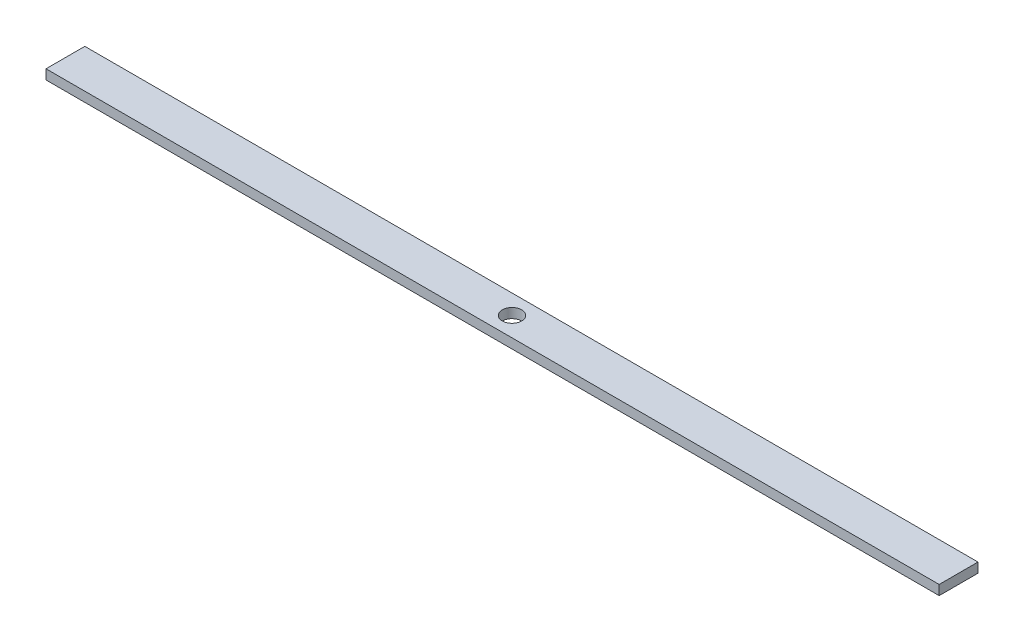
ISO-10303-21;
HEADER;
FILE_DESCRIPTION(('STEP AP214'),'2;1');
FILE_NAME('part.step','',(''),(''),'','','');
FILE_SCHEMA(('AUTOMOTIVE_DESIGN { 1 0 10303 214 1 1 1 1 }'));
ENDSEC;
DATA;
#1=APPLICATION_CONTEXT('core data for automotive mechanical design processes');
#2=APPLICATION_PROTOCOL_DEFINITION('international standard','automotive_design',2000,#1);
#3=PRODUCT_CONTEXT('',#1,'mechanical');
#4=PRODUCT('Part','Part','',(#3));
#5=PRODUCT_RELATED_PRODUCT_CATEGORY('part','',(#4));
#6=PRODUCT_DEFINITION_FORMATION('','',#4);
#7=PRODUCT_DEFINITION_CONTEXT('part definition',#1,'design');
#8=PRODUCT_DEFINITION('design','',#6,#7);
#9=PRODUCT_DEFINITION_SHAPE('','',#8);
#10=(LENGTH_UNIT() NAMED_UNIT(*) SI_UNIT(.MILLI.,.METRE.));
#11=(NAMED_UNIT(*) PLANE_ANGLE_UNIT() SI_UNIT($,.RADIAN.));
#12=(NAMED_UNIT(*) SI_UNIT($,.STERADIAN.) SOLID_ANGLE_UNIT());
#13=UNCERTAINTY_MEASURE_WITH_UNIT(LENGTH_MEASURE(1.E-05),#10,'distance_accuracy_value','');
#14=(GEOMETRIC_REPRESENTATION_CONTEXT(3) GLOBAL_UNCERTAINTY_ASSIGNED_CONTEXT((#13)) GLOBAL_UNIT_ASSIGNED_CONTEXT((#10,
#11,#12)) REPRESENTATION_CONTEXT('',''));
#15=CARTESIAN_POINT('',(0.,0.,0.));
#16=DIRECTION('',(0.,0.,1.));
#17=DIRECTION('',(1.,0.,0.));
#18=AXIS2_PLACEMENT_3D('',#15,#16,#17);
#19=CARTESIAN_POINT('',(0.,6.35,0.));
#20=DIRECTION('',(0.,1.,0.));
#21=DIRECTION('',(0.,0.,1.));
#22=AXIS2_PLACEMENT_3D('',#19,#20,#21);
#23=PLANE('',#22);
#24=DIRECTION('',(0.,0.,-1.));
#25=VECTOR('',#24,1.);
#26=CARTESIAN_POINT('',(292.099999999998,6.35,-12.6999999999999));
#27=LINE('',#26,#25);
#28=CARTESIAN_POINT('',(292.099999999998,6.35,12.7));
#29=VERTEX_POINT('',#28);
#30=CARTESIAN_POINT('',(292.099999999998,6.35,-12.6999999999999));
#31=VERTEX_POINT('',#30);
#32=EDGE_CURVE('E92',#29,#31,#27,.T.);
#33=ORIENTED_EDGE('',*,*,#32,.T.);
#34=DIRECTION('',(-1.,0.,0.));
#35=VECTOR('',#34,1.);
#36=CARTESIAN_POINT('',(-292.100000000002,6.35,-12.6999999999999));
#37=LINE('',#36,#35);
#38=CARTESIAN_POINT('',(-292.100000000002,6.35,-12.6999999999999));
#39=VERTEX_POINT('',#38);
#40=EDGE_CURVE('E87',#31,#39,#37,.T.);
#41=ORIENTED_EDGE('',*,*,#40,.T.);
#42=DIRECTION('',(0.,0.,1.));
#43=VECTOR('',#42,1.);
#44=CARTESIAN_POINT('',(-292.100000000002,6.35,-12.6999999999999));
#45=LINE('',#44,#43);
#46=CARTESIAN_POINT('',(-292.100000000002,6.35,12.7));
#47=VERTEX_POINT('',#46);
#48=EDGE_CURVE('E90',#39,#47,#45,.T.);
#49=ORIENTED_EDGE('',*,*,#48,.T.);
#50=DIRECTION('',(1.,0.,0.));
#51=VECTOR('',#50,1.);
#52=CARTESIAN_POINT('',(-292.100000000002,6.35,12.7));
#53=LINE('',#52,#51);
#54=EDGE_CURVE('E57',#47,#29,#53,.T.);
#55=ORIENTED_EDGE('',*,*,#54,.T.);
#56=EDGE_LOOP('',(#33,#41,#49,#55));
#57=FACE_BOUND('',#56,.T.);
#58=CARTESIAN_POINT('',(-2.22044604925031E-12,6.35,0.));
#59=DIRECTION('',(0.,1.,0.));
#60=DIRECTION('',(0.,0.,1.));
#61=AXIS2_PLACEMENT_3D('',#58,#59,#60);
#62=CIRCLE('',#61,6.35);
#63=CARTESIAN_POINT('',(-2.22044604925031E-12,6.35,6.35000000000005));
#64=VERTEX_POINT('',#63);
#65=EDGE_CURVE('E112',#64,#64,#62,.T.);
#66=ORIENTED_EDGE('',*,*,#65,.F.);
#67=EDGE_LOOP('',(#66));
#68=FACE_BOUND('',#67,.T.);
#69=ADVANCED_FACE('F39',(#57,#68),#23,.T.);
#70=CARTESIAN_POINT('',(0.,0.,0.));
#71=DIRECTION('',(0.,1.,0.));
#72=DIRECTION('',(0.,0.,1.));
#73=AXIS2_PLACEMENT_3D('',#70,#71,#72);
#74=PLANE('',#73);
#75=DIRECTION('',(0.,0.,-1.));
#76=VECTOR('',#75,1.);
#77=CARTESIAN_POINT('',(292.099999999998,0.,-12.6999999999999));
#78=LINE('',#77,#76);
#79=CARTESIAN_POINT('',(292.099999999998,0.,12.7));
#80=VERTEX_POINT('',#79);
#81=CARTESIAN_POINT('',(292.099999999998,0.,-12.6999999999999));
#82=VERTEX_POINT('',#81);
#83=EDGE_CURVE('E108',#80,#82,#78,.T.);
#84=ORIENTED_EDGE('',*,*,#83,.F.);
#85=DIRECTION('',(1.,0.,0.));
#86=VECTOR('',#85,1.);
#87=CARTESIAN_POINT('',(-292.100000000002,0.,12.7));
#88=LINE('',#87,#86);
#89=CARTESIAN_POINT('',(-292.100000000002,0.,12.7));
#90=VERTEX_POINT('',#89);
#91=EDGE_CURVE('E80',#90,#80,#88,.T.);
#92=ORIENTED_EDGE('',*,*,#91,.F.);
#93=DIRECTION('',(0.,0.,1.));
#94=VECTOR('',#93,1.);
#95=CARTESIAN_POINT('',(-292.100000000002,0.,-12.6999999999999));
#96=LINE('',#95,#94);
#97=CARTESIAN_POINT('',(-292.100000000002,0.,-12.6999999999999));
#98=VERTEX_POINT('',#97);
#99=EDGE_CURVE('E74',#98,#90,#96,.T.);
#100=ORIENTED_EDGE('',*,*,#99,.F.);
#101=DIRECTION('',(-1.,0.,0.));
#102=VECTOR('',#101,1.);
#103=CARTESIAN_POINT('',(-292.100000000002,0.,-12.6999999999999));
#104=LINE('',#103,#102);
#105=EDGE_CURVE('E97',#82,#98,#104,.T.);
#106=ORIENTED_EDGE('',*,*,#105,.F.);
#107=EDGE_LOOP('',(#84,#92,#100,#106));
#108=FACE_BOUND('',#107,.T.);
#109=CARTESIAN_POINT('',(-2.22044604925031E-12,0.,0.));
#110=DIRECTION('',(0.,1.,0.));
#111=DIRECTION('',(0.,0.,1.));
#112=AXIS2_PLACEMENT_3D('',#109,#110,#111);
#113=CIRCLE('',#112,6.35);
#114=CARTESIAN_POINT('',(-2.22044604925031E-12,0.,6.35000000000005));
#115=VERTEX_POINT('',#114);
#116=EDGE_CURVE('E130',#115,#115,#113,.T.);
#117=ORIENTED_EDGE('',*,*,#116,.T.);
#118=EDGE_LOOP('',(#117));
#119=FACE_BOUND('',#118,.T.);
#120=ADVANCED_FACE('F125',(#108,#119),#74,.F.);
#121=CARTESIAN_POINT('',(292.099999999998,6.35,-12.6999999999999));
#122=DIRECTION('',(-1.,0.,0.));
#123=DIRECTION('',(0.,0.,1.));
#124=AXIS2_PLACEMENT_3D('',#121,#122,#123);
#125=PLANE('',#124);
#126=ORIENTED_EDGE('',*,*,#83,.T.);
#127=DIRECTION('',(0.,-1.,0.));
#128=VECTOR('',#127,1.);
#129=CARTESIAN_POINT('',(292.099999999998,6.35,-12.6999999999999));
#130=LINE('',#129,#128);
#131=EDGE_CURVE('E11',#31,#82,#130,.T.);
#132=ORIENTED_EDGE('',*,*,#131,.F.);
#133=ORIENTED_EDGE('',*,*,#32,.F.);
#134=DIRECTION('',(0.,-1.,0.));
#135=VECTOR('',#134,1.);
#136=CARTESIAN_POINT('',(292.099999999998,6.35,12.7));
#137=LINE('',#136,#135);
#138=EDGE_CURVE('E104',#29,#80,#137,.T.);
#139=ORIENTED_EDGE('',*,*,#138,.T.);
#140=EDGE_LOOP('',(#126,#132,#133,#139));
#141=FACE_BOUND('',#140,.T.);
#142=ADVANCED_FACE('F41',(#141),#125,.F.);
#143=CARTESIAN_POINT('',(-292.100000000002,6.35,-12.6999999999999));
#144=DIRECTION('',(0.,0.,1.));
#145=DIRECTION('',(1.,0.,0.));
#146=AXIS2_PLACEMENT_3D('',#143,#144,#145);
#147=PLANE('',#146);
#148=ORIENTED_EDGE('',*,*,#105,.T.);
#149=DIRECTION('',(0.,-1.,0.));
#150=VECTOR('',#149,1.);
#151=CARTESIAN_POINT('',(-292.100000000002,6.35,-12.6999999999999));
#152=LINE('',#151,#150);
#153=EDGE_CURVE('E49',#39,#98,#152,.T.);
#154=ORIENTED_EDGE('',*,*,#153,.F.);
#155=ORIENTED_EDGE('',*,*,#40,.F.);
#156=ORIENTED_EDGE('',*,*,#131,.T.);
#157=EDGE_LOOP('',(#148,#154,#155,#156));
#158=FACE_BOUND('',#157,.T.);
#159=ADVANCED_FACE('F96',(#158),#147,.F.);
#160=CARTESIAN_POINT('',(-292.100000000002,6.35,-12.6999999999999));
#161=DIRECTION('',(1.,0.,0.));
#162=DIRECTION('',(0.,0.,-1.));
#163=AXIS2_PLACEMENT_3D('',#160,#161,#162);
#164=PLANE('',#163);
#165=ORIENTED_EDGE('',*,*,#99,.T.);
#166=DIRECTION('',(0.,-1.,0.));
#167=VECTOR('',#166,1.);
#168=CARTESIAN_POINT('',(-292.100000000002,6.35,12.7));
#169=LINE('',#168,#167);
#170=EDGE_CURVE('E99',#47,#90,#169,.T.);
#171=ORIENTED_EDGE('',*,*,#170,.F.);
#172=ORIENTED_EDGE('',*,*,#48,.F.);
#173=ORIENTED_EDGE('',*,*,#153,.T.);
#174=EDGE_LOOP('',(#165,#171,#172,#173));
#175=FACE_BOUND('',#174,.T.);
#176=ADVANCED_FACE('F100',(#175),#164,.F.);
#177=CARTESIAN_POINT('',(-292.100000000002,6.35,12.7));
#178=DIRECTION('',(0.,0.,-1.));
#179=DIRECTION('',(-1.,0.,0.));
#180=AXIS2_PLACEMENT_3D('',#177,#178,#179);
#181=PLANE('',#180);
#182=ORIENTED_EDGE('',*,*,#91,.T.);
#183=ORIENTED_EDGE('',*,*,#138,.F.);
#184=ORIENTED_EDGE('',*,*,#54,.F.);
#185=ORIENTED_EDGE('',*,*,#170,.T.);
#186=EDGE_LOOP('',(#182,#183,#184,#185));
#187=FACE_BOUND('',#186,.T.);
#188=ADVANCED_FACE('F122',(#187),#181,.F.);
#189=CARTESIAN_POINT('',(-2.22044604925031E-12,6.35,0.));
#190=DIRECTION('',(0.,-1.,0.));
#191=DIRECTION('',(0.,0.,-1.));
#192=AXIS2_PLACEMENT_3D('',#189,#190,#191);
#193=CYLINDRICAL_SURFACE('',#192,6.35);
#194=ORIENTED_EDGE('',*,*,#65,.T.);
#195=EDGE_LOOP('',(#194));
#196=FACE_BOUND('',#195,.T.);
#197=ORIENTED_EDGE('',*,*,#116,.F.);
#198=EDGE_LOOP('',(#197));
#199=FACE_BOUND('',#198,.T.);
#200=ADVANCED_FACE('F138',(#196,#199),#193,.F.);
#201=CLOSED_SHELL('',(#69,#120,#142,#159,#176,#188,#200));
#202=MANIFOLD_SOLID_BREP('B2',#201);
#203=ADVANCED_BREP_SHAPE_REPRESENTATION('',(#18,#202),#14);
#204=SHAPE_DEFINITION_REPRESENTATION(#9,#203);
ENDSEC;
END-ISO-10303-21;
